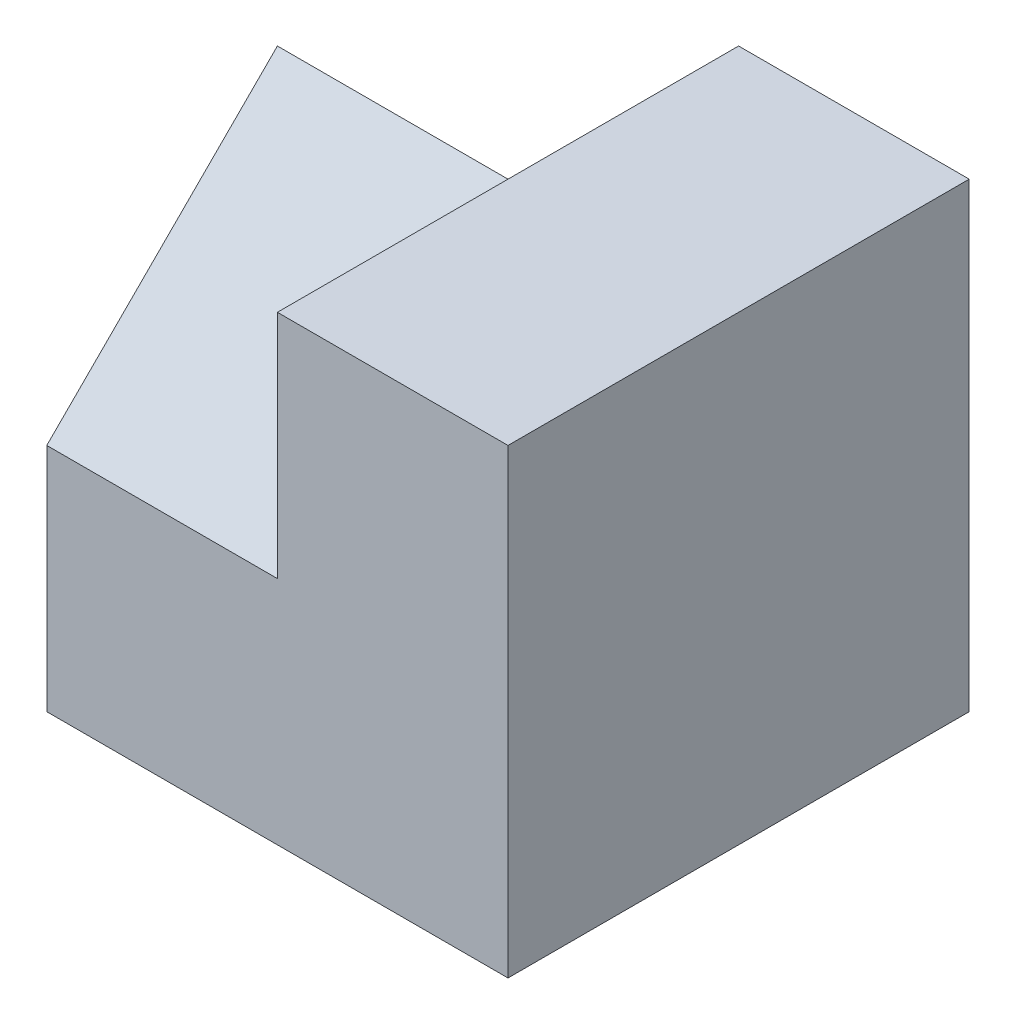
ISO-10303-21;
HEADER;
FILE_DESCRIPTION(('STEP AP214'),'2;1');
FILE_NAME('part.step','',(''),(''),'','','');
FILE_SCHEMA(('AUTOMOTIVE_DESIGN { 1 0 10303 214 1 1 1 1 }'));
ENDSEC;
DATA;
#1=APPLICATION_CONTEXT('core data for automotive mechanical design processes');
#2=APPLICATION_PROTOCOL_DEFINITION('international standard','automotive_design',2000,#1);
#3=PRODUCT_CONTEXT('',#1,'mechanical');
#4=PRODUCT('Part','Part','',(#3));
#5=PRODUCT_RELATED_PRODUCT_CATEGORY('part','',(#4));
#6=PRODUCT_DEFINITION_FORMATION('','',#4);
#7=PRODUCT_DEFINITION_CONTEXT('part definition',#1,'design');
#8=PRODUCT_DEFINITION('design','',#6,#7);
#9=PRODUCT_DEFINITION_SHAPE('','',#8);
#10=(LENGTH_UNIT() NAMED_UNIT(*) SI_UNIT(.MILLI.,.METRE.));
#11=(NAMED_UNIT(*) PLANE_ANGLE_UNIT() SI_UNIT($,.RADIAN.));
#12=(NAMED_UNIT(*) SI_UNIT($,.STERADIAN.) SOLID_ANGLE_UNIT());
#13=UNCERTAINTY_MEASURE_WITH_UNIT(LENGTH_MEASURE(1.E-05),#10,'distance_accuracy_value','');
#14=(GEOMETRIC_REPRESENTATION_CONTEXT(3) GLOBAL_UNCERTAINTY_ASSIGNED_CONTEXT((#13)) GLOBAL_UNIT_ASSIGNED_CONTEXT((#10,
#11,#12)) REPRESENTATION_CONTEXT('',''));
#15=CARTESIAN_POINT('',(0.,0.,0.));
#16=DIRECTION('',(0.,0.,1.));
#17=DIRECTION('',(1.,0.,0.));
#18=AXIS2_PLACEMENT_3D('',#15,#16,#17);
#19=CARTESIAN_POINT('',(-2.,4.,2.));
#20=DIRECTION('',(1.,0.,0.));
#21=DIRECTION('',(0.,0.,-1.));
#22=AXIS2_PLACEMENT_3D('',#19,#20,#21);
#23=PLANE('',#22);
#24=DIRECTION('',(0.,0.707106781186548,-0.707106781186548));
#25=VECTOR('',#24,1.);
#26=CARTESIAN_POINT('',(-2.,2.,2.));
#27=LINE('',#26,#25);
#28=CARTESIAN_POINT('',(-2.,2.,2.));
#29=VERTEX_POINT('',#28);
#30=CARTESIAN_POINT('',(-2.,4.,0.));
#31=VERTEX_POINT('',#30);
#32=EDGE_CURVE('E157',#29,#31,#27,.T.);
#33=ORIENTED_EDGE('',*,*,#32,.T.);
#34=CARTESIAN_POINT('',(-2.,4.,-2.));
#35=DIRECTION('',(-1.,0.,0.));
#36=DIRECTION('',(0.,0.,1.));
#37=AXIS2_PLACEMENT_3D('',#34,#35,#36);
#38=CIRCLE('',#37,2.);
#39=CARTESIAN_POINT('',(-2.,2.,-2.));
#40=VERTEX_POINT('',#39);
#41=EDGE_CURVE('E131',#31,#40,#38,.F.);
#42=ORIENTED_EDGE('',*,*,#41,.T.);
#43=DIRECTION('',(0.,-1.,0.));
#44=VECTOR('',#43,1.);
#45=CARTESIAN_POINT('',(-2.,4.,-2.));
#46=LINE('',#45,#44);
#47=CARTESIAN_POINT('',(-2.,0.,-2.));
#48=VERTEX_POINT('',#47);
#49=EDGE_CURVE('E58',#40,#48,#46,.T.);
#50=ORIENTED_EDGE('',*,*,#49,.T.);
#51=DIRECTION('',(0.,0.,1.));
#52=VECTOR('',#51,1.);
#53=CARTESIAN_POINT('',(-2.,0.,2.));
#54=LINE('',#53,#52);
#55=CARTESIAN_POINT('',(-2.,0.,2.));
#56=VERTEX_POINT('',#55);
#57=EDGE_CURVE('E105',#48,#56,#54,.T.);
#58=ORIENTED_EDGE('',*,*,#57,.T.);
#59=DIRECTION('',(0.,-1.,0.));
#60=VECTOR('',#59,1.);
#61=CARTESIAN_POINT('',(-2.,4.,2.));
#62=LINE('',#61,#60);
#63=EDGE_CURVE('E99',#29,#56,#62,.T.);
#64=ORIENTED_EDGE('',*,*,#63,.F.);
#65=EDGE_LOOP('',(#33,#42,#50,#58,#64));
#66=FACE_BOUND('',#65,.T.);
#67=ADVANCED_FACE('F50',(#66),#23,.F.);
#68=CARTESIAN_POINT('',(0.,4.,0.));
#69=DIRECTION('',(0.,-1.,0.));
#70=DIRECTION('',(0.,0.,-1.));
#71=AXIS2_PLACEMENT_3D('',#68,#69,#70);
#72=PLANE('',#71);
#73=DIRECTION('',(0.,0.,-1.));
#74=VECTOR('',#73,1.);
#75=CARTESIAN_POINT('',(0.,4.,0.));
#76=LINE('',#75,#74);
#77=CARTESIAN_POINT('',(0.,4.,2.));
#78=VERTEX_POINT('',#77);
#79=CARTESIAN_POINT('',(0.,4.,0.));
#80=VERTEX_POINT('',#79);
#81=EDGE_CURVE('E65',#78,#80,#76,.T.);
#82=ORIENTED_EDGE('',*,*,#81,.F.);
#83=DIRECTION('',(1.,0.,0.));
#84=VECTOR('',#83,1.);
#85=CARTESIAN_POINT('',(-2.,4.,2.));
#86=LINE('',#85,#84);
#87=CARTESIAN_POINT('',(2.,4.,2.));
#88=VERTEX_POINT('',#87);
#89=EDGE_CURVE('E73',#78,#88,#86,.T.);
#90=ORIENTED_EDGE('',*,*,#89,.T.);
#91=DIRECTION('',(0.,0.,-1.));
#92=VECTOR('',#91,1.);
#93=CARTESIAN_POINT('',(2.,4.,2.));
#94=LINE('',#93,#92);
#95=CARTESIAN_POINT('',(2.,4.,-2.));
#96=VERTEX_POINT('',#95);
#97=EDGE_CURVE('E104',#88,#96,#94,.T.);
#98=ORIENTED_EDGE('',*,*,#97,.T.);
#99=DIRECTION('',(-1.,0.,0.));
#100=VECTOR('',#99,1.);
#101=CARTESIAN_POINT('',(-2.,4.,-2.));
#102=LINE('',#101,#100);
#103=CARTESIAN_POINT('',(0.,4.,-2.));
#104=VERTEX_POINT('',#103);
#105=EDGE_CURVE('E137',#96,#104,#102,.T.);
#106=ORIENTED_EDGE('',*,*,#105,.T.);
#107=DIRECTION('',(0.,0.,-1.));
#108=VECTOR('',#107,1.);
#109=CARTESIAN_POINT('',(0.,4.,0.));
#110=LINE('',#109,#108);
#111=EDGE_CURVE('E151',#80,#104,#110,.T.);
#112=ORIENTED_EDGE('',*,*,#111,.F.);
#113=EDGE_LOOP('',(#82,#90,#98,#106,#112));
#114=FACE_BOUND('',#113,.T.);
#115=ADVANCED_FACE('F142',(#114),#72,.F.);
#116=CARTESIAN_POINT('',(-2.,4.,2.));
#117=DIRECTION('',(0.,0.,-1.));
#118=DIRECTION('',(-1.,0.,0.));
#119=AXIS2_PLACEMENT_3D('',#116,#117,#118);
#120=PLANE('',#119);
#121=DIRECTION('',(-1.,0.,0.));
#122=VECTOR('',#121,1.);
#123=CARTESIAN_POINT('',(0.,2.,2.));
#124=LINE('',#123,#122);
#125=CARTESIAN_POINT('',(0.,2.,2.));
#126=VERTEX_POINT('',#125);
#127=EDGE_CURVE('E149',#126,#29,#124,.T.);
#128=ORIENTED_EDGE('',*,*,#127,.T.);
#129=ORIENTED_EDGE('',*,*,#63,.T.);
#130=DIRECTION('',(1.,0.,0.));
#131=VECTOR('',#130,1.);
#132=CARTESIAN_POINT('',(-2.,0.,2.));
#133=LINE('',#132,#131);
#134=CARTESIAN_POINT('',(2.,0.,2.));
#135=VERTEX_POINT('',#134);
#136=EDGE_CURVE('E92',#56,#135,#133,.T.);
#137=ORIENTED_EDGE('',*,*,#136,.T.);
#138=DIRECTION('',(0.,-1.,0.));
#139=VECTOR('',#138,1.);
#140=CARTESIAN_POINT('',(2.,4.,2.));
#141=LINE('',#140,#139);
#142=EDGE_CURVE('E96',#88,#135,#141,.T.);
#143=ORIENTED_EDGE('',*,*,#142,.F.);
#144=ORIENTED_EDGE('',*,*,#89,.F.);
#145=DIRECTION('',(0.,1.,0.));
#146=VECTOR('',#145,1.);
#147=CARTESIAN_POINT('',(0.,0.,2.));
#148=LINE('',#147,#146);
#149=EDGE_CURVE('E161',#126,#78,#148,.T.);
#150=ORIENTED_EDGE('',*,*,#149,.F.);
#151=EDGE_LOOP('',(#128,#129,#137,#143,#144,#150));
#152=FACE_BOUND('',#151,.T.);
#153=ADVANCED_FACE('F95',(#152),#120,.F.);
#154=CARTESIAN_POINT('',(-2.,4.,-2.));
#155=DIRECTION('',(0.,0.,1.));
#156=DIRECTION('',(1.,0.,0.));
#157=AXIS2_PLACEMENT_3D('',#154,#155,#156);
#158=PLANE('',#157);
#159=DIRECTION('',(-1.,0.,0.));
#160=VECTOR('',#159,1.);
#161=CARTESIAN_POINT('',(0.,2.,-2.));
#162=LINE('',#161,#160);
#163=CARTESIAN_POINT('',(0.,2.,-2.));
#164=VERTEX_POINT('',#163);
#165=EDGE_CURVE('E115',#164,#40,#162,.T.);
#166=ORIENTED_EDGE('',*,*,#165,.F.);
#167=DIRECTION('',(0.,-1.,0.));
#168=VECTOR('',#167,1.);
#169=CARTESIAN_POINT('',(0.,0.,-2.));
#170=LINE('',#169,#168);
#171=EDGE_CURVE('E140',#104,#164,#170,.T.);
#172=ORIENTED_EDGE('',*,*,#171,.F.);
#173=ORIENTED_EDGE('',*,*,#105,.F.);
#174=DIRECTION('',(0.,-1.,0.));
#175=VECTOR('',#174,1.);
#176=CARTESIAN_POINT('',(2.,4.,-2.));
#177=LINE('',#176,#175);
#178=CARTESIAN_POINT('',(2.,0.,-2.));
#179=VERTEX_POINT('',#178);
#180=EDGE_CURVE('E12',#96,#179,#177,.T.);
#181=ORIENTED_EDGE('',*,*,#180,.T.);
#182=DIRECTION('',(-1.,0.,0.));
#183=VECTOR('',#182,1.);
#184=CARTESIAN_POINT('',(-2.,0.,-2.));
#185=LINE('',#184,#183);
#186=EDGE_CURVE('E114',#179,#48,#185,.T.);
#187=ORIENTED_EDGE('',*,*,#186,.T.);
#188=ORIENTED_EDGE('',*,*,#49,.F.);
#189=EDGE_LOOP('',(#166,#172,#173,#181,#187,#188));
#190=FACE_BOUND('',#189,.T.);
#191=ADVANCED_FACE('F134',(#190),#158,.F.);
#192=CARTESIAN_POINT('',(2.,4.,2.));
#193=DIRECTION('',(-1.,0.,0.));
#194=DIRECTION('',(0.,0.,1.));
#195=AXIS2_PLACEMENT_3D('',#192,#193,#194);
#196=PLANE('',#195);
#197=DIRECTION('',(0.,0.,-1.));
#198=VECTOR('',#197,1.);
#199=CARTESIAN_POINT('',(2.,0.,2.));
#200=LINE('',#199,#198);
#201=EDGE_CURVE('E110',#135,#179,#200,.T.);
#202=ORIENTED_EDGE('',*,*,#201,.T.);
#203=ORIENTED_EDGE('',*,*,#180,.F.);
#204=ORIENTED_EDGE('',*,*,#97,.F.);
#205=ORIENTED_EDGE('',*,*,#142,.T.);
#206=EDGE_LOOP('',(#202,#203,#204,#205));
#207=FACE_BOUND('',#206,.T.);
#208=ADVANCED_FACE('F52',(#207),#196,.F.);
#209=CARTESIAN_POINT('',(0.,0.,0.));
#210=DIRECTION('',(0.,-1.,0.));
#211=DIRECTION('',(0.,0.,-1.));
#212=AXIS2_PLACEMENT_3D('',#209,#210,#211);
#213=PLANE('',#212);
#214=ORIENTED_EDGE('',*,*,#201,.F.);
#215=ORIENTED_EDGE('',*,*,#136,.F.);
#216=ORIENTED_EDGE('',*,*,#57,.F.);
#217=ORIENTED_EDGE('',*,*,#186,.F.);
#218=EDGE_LOOP('',(#214,#215,#216,#217));
#219=FACE_BOUND('',#218,.T.);
#220=ADVANCED_FACE('F112',(#219),#213,.T.);
#221=CARTESIAN_POINT('',(0.,4.,-2.));
#222=DIRECTION('',(-1.,0.,0.));
#223=DIRECTION('',(0.,0.,1.));
#224=AXIS2_PLACEMENT_3D('',#221,#222,#223);
#225=CYLINDRICAL_SURFACE('',#224,2.);
#226=ORIENTED_EDGE('',*,*,#41,.F.);
#227=DIRECTION('',(-1.,0.,0.));
#228=VECTOR('',#227,1.);
#229=CARTESIAN_POINT('',(0.,4.,0.));
#230=LINE('',#229,#228);
#231=EDGE_CURVE('E119',#80,#31,#230,.T.);
#232=ORIENTED_EDGE('',*,*,#231,.F.);
#233=CARTESIAN_POINT('',(0.,4.,-2.));
#234=DIRECTION('',(-1.,0.,0.));
#235=DIRECTION('',(0.,0.,1.));
#236=AXIS2_PLACEMENT_3D('',#233,#234,#235);
#237=CIRCLE('',#236,2.);
#238=EDGE_CURVE('E148',#80,#164,#237,.F.);
#239=ORIENTED_EDGE('',*,*,#238,.T.);
#240=ORIENTED_EDGE('',*,*,#165,.T.);
#241=EDGE_LOOP('',(#226,#232,#239,#240));
#242=FACE_BOUND('',#241,.T.);
#243=ADVANCED_FACE('F175',(#242),#225,.F.);
#244=CARTESIAN_POINT('',(0.,0.,0.));
#245=DIRECTION('',(-1.,0.,0.));
#246=DIRECTION('',(0.,0.,1.));
#247=AXIS2_PLACEMENT_3D('',#244,#245,#246);
#248=PLANE('',#247);
#249=ORIENTED_EDGE('',*,*,#238,.F.);
#250=ORIENTED_EDGE('',*,*,#111,.T.);
#251=ORIENTED_EDGE('',*,*,#171,.T.);
#252=EDGE_LOOP('',(#249,#250,#251));
#253=FACE_BOUND('',#252,.T.);
#254=ADVANCED_FACE('F173',(#253),#248,.T.);
#255=CARTESIAN_POINT('',(0.,2.,2.));
#256=DIRECTION('',(0.,0.707106781186547,0.707106781186547));
#257=DIRECTION('',(0.,-0.707106781186548,0.707106781186548));
#258=AXIS2_PLACEMENT_3D('',#255,#256,#257);
#259=PLANE('',#258);
#260=ORIENTED_EDGE('',*,*,#32,.F.);
#261=ORIENTED_EDGE('',*,*,#127,.F.);
#262=DIRECTION('',(0.,0.707106781186548,-0.707106781186548));
#263=VECTOR('',#262,1.);
#264=CARTESIAN_POINT('',(0.,2.,2.));
#265=LINE('',#264,#263);
#266=EDGE_CURVE('E159',#126,#80,#265,.T.);
#267=ORIENTED_EDGE('',*,*,#266,.T.);
#268=ORIENTED_EDGE('',*,*,#231,.T.);
#269=EDGE_LOOP('',(#260,#261,#267,#268));
#270=FACE_BOUND('',#269,.T.);
#271=ADVANCED_FACE('F167',(#270),#259,.T.);
#272=CARTESIAN_POINT('',(0.,0.,0.));
#273=DIRECTION('',(-1.,0.,0.));
#274=DIRECTION('',(0.,0.,1.));
#275=AXIS2_PLACEMENT_3D('',#272,#273,#274);
#276=PLANE('',#275);
#277=ORIENTED_EDGE('',*,*,#266,.F.);
#278=ORIENTED_EDGE('',*,*,#149,.T.);
#279=ORIENTED_EDGE('',*,*,#81,.T.);
#280=EDGE_LOOP('',(#277,#278,#279));
#281=FACE_BOUND('',#280,.T.);
#282=ADVANCED_FACE('F180',(#281),#276,.T.);
#283=CLOSED_SHELL('',(#67,#115,#153,#191,#208,#220,#243,#254,#271,#282));
#284=MANIFOLD_SOLID_BREP('B2',#283);
#285=ADVANCED_BREP_SHAPE_REPRESENTATION('',(#18,#284),#14);
#286=SHAPE_DEFINITION_REPRESENTATION(#9,#285);
ENDSEC;
END-ISO-10303-21;
